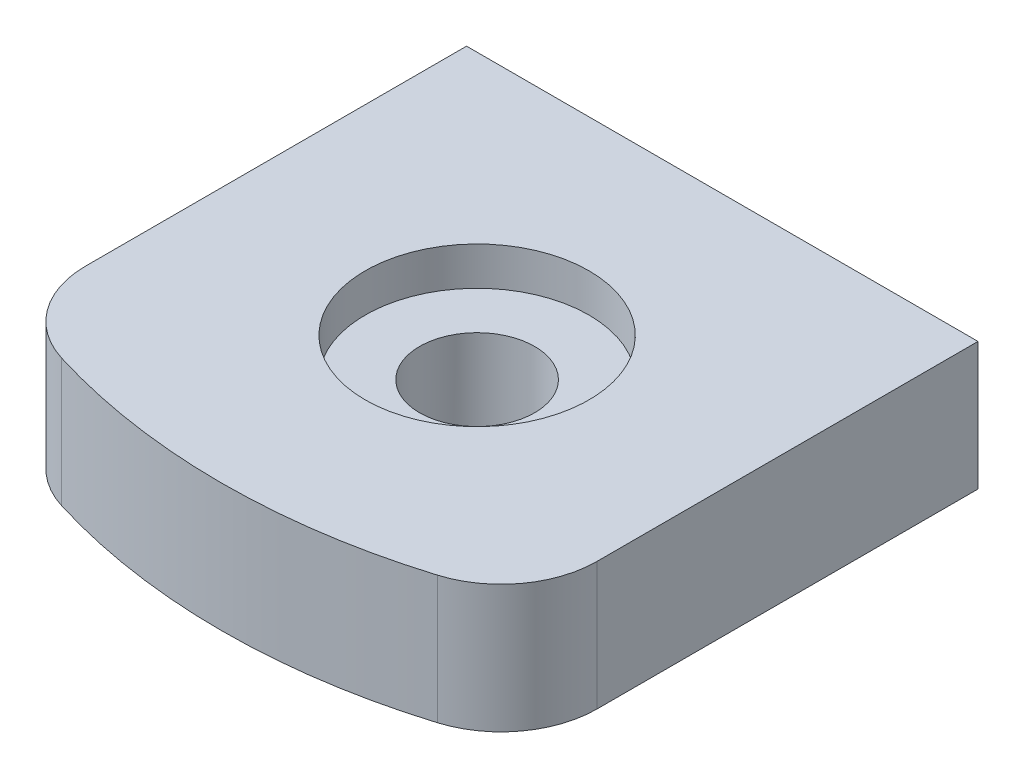
ISO-10303-21;
HEADER;
FILE_DESCRIPTION(('STEP AP214'),'2;1');
FILE_NAME('part.step','',(''),(''),'','','');
FILE_SCHEMA(('AUTOMOTIVE_DESIGN { 1 0 10303 214 1 1 1 1 }'));
ENDSEC;
DATA;
#1=APPLICATION_CONTEXT('core data for automotive mechanical design processes');
#2=APPLICATION_PROTOCOL_DEFINITION('international standard','automotive_design',2000,#1);
#3=PRODUCT_CONTEXT('',#1,'mechanical');
#4=PRODUCT('Part','Part','',(#3));
#5=PRODUCT_RELATED_PRODUCT_CATEGORY('part','',(#4));
#6=PRODUCT_DEFINITION_FORMATION('','',#4);
#7=PRODUCT_DEFINITION_CONTEXT('part definition',#1,'design');
#8=PRODUCT_DEFINITION('design','',#6,#7);
#9=PRODUCT_DEFINITION_SHAPE('','',#8);
#10=(LENGTH_UNIT() NAMED_UNIT(*) SI_UNIT(.MILLI.,.METRE.));
#11=(NAMED_UNIT(*) PLANE_ANGLE_UNIT() SI_UNIT($,.RADIAN.));
#12=(NAMED_UNIT(*) SI_UNIT($,.STERADIAN.) SOLID_ANGLE_UNIT());
#13=UNCERTAINTY_MEASURE_WITH_UNIT(LENGTH_MEASURE(1.E-05),#10,'distance_accuracy_value','');
#14=(GEOMETRIC_REPRESENTATION_CONTEXT(3) GLOBAL_UNCERTAINTY_ASSIGNED_CONTEXT((#13)) GLOBAL_UNIT_ASSIGNED_CONTEXT((#10,
#11,#12)) REPRESENTATION_CONTEXT('',''));
#15=CARTESIAN_POINT('',(0.,0.,0.));
#16=DIRECTION('',(0.,0.,1.));
#17=DIRECTION('',(1.,0.,0.));
#18=AXIS2_PLACEMENT_3D('',#15,#16,#17);
#19=CARTESIAN_POINT('',(-6.,-1.,0.));
#20=DIRECTION('',(0.,-1.,0.));
#21=DIRECTION('',(0.,0.,-1.));
#22=AXIS2_PLACEMENT_3D('',#19,#20,#21);
#23=PLANE('',#22);
#24=CARTESIAN_POINT('',(0.,-1.,74.5433459879591));
#25=DIRECTION('',(0.,-1.,0.));
#26=DIRECTION('',(0.,0.,-1.));
#27=AXIS2_PLACEMENT_3D('',#24,#25,#26);
#28=CIRCLE('',#27,0.900000000000005);
#29=CARTESIAN_POINT('',(0.,-1.,73.6433459879591));
#30=VERTEX_POINT('',#29);
#31=EDGE_CURVE('E137',#30,#30,#28,.F.);
#32=ORIENTED_EDGE('',*,*,#31,.T.);
#33=EDGE_LOOP('',(#32));
#34=FACE_BOUND('',#33,.T.);
#35=DIRECTION('',(1.,0.,0.));
#36=VECTOR('',#35,1.);
#37=CARTESIAN_POINT('',(-6.,-1.,70.7084973778708));
#38=LINE('',#37,#36);
#39=CARTESIAN_POINT('',(-4.,-1.,70.7084973778708));
#40=VERTEX_POINT('',#39);
#41=CARTESIAN_POINT('',(4.,-1.,70.7084973778708));
#42=VERTEX_POINT('',#41);
#43=EDGE_CURVE('E117',#40,#42,#38,.T.);
#44=ORIENTED_EDGE('',*,*,#43,.T.);
#45=DIRECTION('',(0.,0.,1.));
#46=VECTOR('',#45,1.);
#47=CARTESIAN_POINT('',(4.,-1.,12.7084973778708));
#48=LINE('',#47,#46);
#49=CARTESIAN_POINT('',(4.,-1.,76.6673843925951));
#50=VERTEX_POINT('',#49);
#51=EDGE_CURVE('E102',#42,#50,#48,.T.);
#52=ORIENTED_EDGE('',*,*,#51,.T.);
#53=CARTESIAN_POINT('',(2.5,-1.,76.6673843925951));
#54=DIRECTION('',(0.,-1.,0.));
#55=DIRECTION('',(0.,0.,-1.));
#56=AXIS2_PLACEMENT_3D('',#53,#54,#55);
#57=CIRCLE('',#56,1.5);
#58=CARTESIAN_POINT('',(2.94117647058823,-1.,78.1010382287073));
#59=VERTEX_POINT('',#58);
#60=EDGE_CURVE('E60',#59,#50,#57,.F.);
#61=ORIENTED_EDGE('',*,*,#60,.F.);
#62=CARTESIAN_POINT('',(0.,-1.,68.5433459879591));
#63=DIRECTION('',(0.,-1.,0.));
#64=DIRECTION('',(0.,0.,-1.));
#65=AXIS2_PLACEMENT_3D('',#62,#63,#64);
#66=CIRCLE('',#65,10.);
#67=CARTESIAN_POINT('',(-2.94117647058823,-1.,78.1010382287073));
#68=VERTEX_POINT('',#67);
#69=EDGE_CURVE('E112',#59,#68,#66,.T.);
#70=ORIENTED_EDGE('',*,*,#69,.T.);
#71=CARTESIAN_POINT('',(-2.5,-1.,76.6673843925951));
#72=DIRECTION('',(0.,-1.,0.));
#73=DIRECTION('',(0.,0.,-1.));
#74=AXIS2_PLACEMENT_3D('',#71,#72,#73);
#75=CIRCLE('',#74,1.5);
#76=CARTESIAN_POINT('',(-4.,-1.,76.6673843925951));
#77=VERTEX_POINT('',#76);
#78=EDGE_CURVE('E143',#77,#68,#75,.F.);
#79=ORIENTED_EDGE('',*,*,#78,.F.);
#80=DIRECTION('',(0.,0.,-1.));
#81=VECTOR('',#80,1.);
#82=CARTESIAN_POINT('',(-4.,-1.,77.7084973778708));
#83=LINE('',#82,#81);
#84=EDGE_CURVE('E139',#77,#40,#83,.T.);
#85=ORIENTED_EDGE('',*,*,#84,.T.);
#86=EDGE_LOOP('',(#44,#52,#61,#70,#79,#85));
#87=FACE_BOUND('',#86,.T.);
#88=ADVANCED_FACE('F43',(#34,#87),#23,.T.);
#89=CARTESIAN_POINT('',(-6.,1.,0.));
#90=DIRECTION('',(0.,1.,0.));
#91=DIRECTION('',(0.,0.,1.));
#92=AXIS2_PLACEMENT_3D('',#89,#90,#91);
#93=PLANE('',#92);
#94=CARTESIAN_POINT('',(0.,1.,74.5433459879591));
#95=DIRECTION('',(0.,1.,0.));
#96=DIRECTION('',(0.,0.,1.));
#97=AXIS2_PLACEMENT_3D('',#94,#95,#96);
#98=CIRCLE('',#97,1.74999999999999);
#99=CARTESIAN_POINT('',(0.,1.,76.2933459879591));
#100=VERTEX_POINT('',#99);
#101=EDGE_CURVE('E119',#100,#100,#98,.F.);
#102=ORIENTED_EDGE('',*,*,#101,.T.);
#103=EDGE_LOOP('',(#102));
#104=FACE_BOUND('',#103,.T.);
#105=DIRECTION('',(-1.,0.,0.));
#106=VECTOR('',#105,1.);
#107=CARTESIAN_POINT('',(-6.,1.,70.7084973778708));
#108=LINE('',#107,#106);
#109=CARTESIAN_POINT('',(4.,1.,70.7084973778708));
#110=VERTEX_POINT('',#109);
#111=CARTESIAN_POINT('',(-4.,1.,70.7084973778708));
#112=VERTEX_POINT('',#111);
#113=EDGE_CURVE('E111',#110,#112,#108,.T.);
#114=ORIENTED_EDGE('',*,*,#113,.T.);
#115=DIRECTION('',(0.,0.,1.));
#116=VECTOR('',#115,1.);
#117=CARTESIAN_POINT('',(-4.,1.,77.7084973778708));
#118=LINE('',#117,#116);
#119=CARTESIAN_POINT('',(-4.,1.,76.6673843925951));
#120=VERTEX_POINT('',#119);
#121=EDGE_CURVE('E138',#112,#120,#118,.T.);
#122=ORIENTED_EDGE('',*,*,#121,.T.);
#123=CARTESIAN_POINT('',(-2.5,1.,76.6673843925951));
#124=DIRECTION('',(0.,1.,0.));
#125=DIRECTION('',(0.,0.,1.));
#126=AXIS2_PLACEMENT_3D('',#123,#124,#125);
#127=CIRCLE('',#126,1.5);
#128=CARTESIAN_POINT('',(-2.94117647058823,1.,78.1010382287073));
#129=VERTEX_POINT('',#128);
#130=EDGE_CURVE('E142',#129,#120,#127,.F.);
#131=ORIENTED_EDGE('',*,*,#130,.F.);
#132=CARTESIAN_POINT('',(0.,1.,68.5433459879591));
#133=DIRECTION('',(0.,1.,0.));
#134=DIRECTION('',(0.,0.,1.));
#135=AXIS2_PLACEMENT_3D('',#132,#133,#134);
#136=CIRCLE('',#135,10.);
#137=CARTESIAN_POINT('',(2.94117647058823,1.,78.1010382287073));
#138=VERTEX_POINT('',#137);
#139=EDGE_CURVE('E141',#129,#138,#136,.T.);
#140=ORIENTED_EDGE('',*,*,#139,.T.);
#141=CARTESIAN_POINT('',(2.5,1.,76.6673843925951));
#142=DIRECTION('',(0.,1.,0.));
#143=DIRECTION('',(0.,0.,1.));
#144=AXIS2_PLACEMENT_3D('',#141,#142,#143);
#145=CIRCLE('',#144,1.5);
#146=CARTESIAN_POINT('',(4.,1.,76.6673843925951));
#147=VERTEX_POINT('',#146);
#148=EDGE_CURVE('E47',#147,#138,#145,.F.);
#149=ORIENTED_EDGE('',*,*,#148,.F.);
#150=DIRECTION('',(0.,0.,-1.));
#151=VECTOR('',#150,1.);
#152=CARTESIAN_POINT('',(4.,1.,12.7084973778708));
#153=LINE('',#152,#151);
#154=EDGE_CURVE('E101',#147,#110,#153,.T.);
#155=ORIENTED_EDGE('',*,*,#154,.T.);
#156=EDGE_LOOP('',(#114,#122,#131,#140,#149,#155));
#157=FACE_BOUND('',#156,.T.);
#158=ADVANCED_FACE('F109',(#104,#157),#93,.T.);
#159=CARTESIAN_POINT('',(0.,2.5,68.5433459879591));
#160=DIRECTION('',(0.,-1.,0.));
#161=DIRECTION('',(0.,0.,-1.));
#162=AXIS2_PLACEMENT_3D('',#159,#160,#161);
#163=CYLINDRICAL_SURFACE('',#162,10.);
#164=DIRECTION('',(0.,-1.,0.));
#165=VECTOR('',#164,1.);
#166=CARTESIAN_POINT('',(2.94117647058823,2.5,78.1010382287073));
#167=LINE('',#166,#165);
#168=EDGE_CURVE('E123',#59,#138,#167,.F.);
#169=ORIENTED_EDGE('',*,*,#168,.T.);
#170=ORIENTED_EDGE('',*,*,#139,.F.);
#171=DIRECTION('',(0.,-1.,0.));
#172=VECTOR('',#171,1.);
#173=CARTESIAN_POINT('',(-2.94117647058823,2.5,78.1010382287073));
#174=LINE('',#173,#172);
#175=EDGE_CURVE('E127',#129,#68,#174,.T.);
#176=ORIENTED_EDGE('',*,*,#175,.T.);
#177=ORIENTED_EDGE('',*,*,#69,.F.);
#178=EDGE_LOOP('',(#169,#170,#176,#177));
#179=FACE_BOUND('',#178,.T.);
#180=ADVANCED_FACE('F173',(#179),#163,.T.);
#181=CARTESIAN_POINT('',(4.,2.5,12.7084973778708));
#182=DIRECTION('',(-1.,0.,0.));
#183=DIRECTION('',(0.,0.,1.));
#184=AXIS2_PLACEMENT_3D('',#181,#182,#183);
#185=PLANE('',#184);
#186=ORIENTED_EDGE('',*,*,#154,.F.);
#187=DIRECTION('',(0.,-1.,0.));
#188=VECTOR('',#187,1.);
#189=CARTESIAN_POINT('',(4.,2.5,76.6673843925951));
#190=LINE('',#189,#188);
#191=EDGE_CURVE('E133',#147,#50,#190,.T.);
#192=ORIENTED_EDGE('',*,*,#191,.T.);
#193=ORIENTED_EDGE('',*,*,#51,.F.);
#194=DIRECTION('',(0.,1.,0.));
#195=VECTOR('',#194,1.);
#196=CARTESIAN_POINT('',(4.,2.5,70.7084973778708));
#197=LINE('',#196,#195);
#198=EDGE_CURVE('E11',#42,#110,#197,.T.);
#199=ORIENTED_EDGE('',*,*,#198,.T.);
#200=EDGE_LOOP('',(#186,#192,#193,#199));
#201=FACE_BOUND('',#200,.T.);
#202=ADVANCED_FACE('F99',(#201),#185,.F.);
#203=CARTESIAN_POINT('',(-4.,2.5,77.7084973778708));
#204=DIRECTION('',(1.,0.,0.));
#205=DIRECTION('',(0.,0.,-1.));
#206=AXIS2_PLACEMENT_3D('',#203,#204,#205);
#207=PLANE('',#206);
#208=ORIENTED_EDGE('',*,*,#121,.F.);
#209=DIRECTION('',(0.,-1.,0.));
#210=VECTOR('',#209,1.);
#211=CARTESIAN_POINT('',(-4.,2.5,70.7084973778708));
#212=LINE('',#211,#210);
#213=EDGE_CURVE('E115',#112,#40,#212,.T.);
#214=ORIENTED_EDGE('',*,*,#213,.T.);
#215=ORIENTED_EDGE('',*,*,#84,.F.);
#216=DIRECTION('',(0.,-1.,0.));
#217=VECTOR('',#216,1.);
#218=CARTESIAN_POINT('',(-4.,2.5,76.6673843925951));
#219=LINE('',#218,#217);
#220=EDGE_CURVE('E130',#77,#120,#219,.F.);
#221=ORIENTED_EDGE('',*,*,#220,.T.);
#222=EDGE_LOOP('',(#208,#214,#215,#221));
#223=FACE_BOUND('',#222,.T.);
#224=ADVANCED_FACE('F181',(#223),#207,.F.);
#225=CARTESIAN_POINT('',(0.,0.,70.7084973778708));
#226=DIRECTION('',(0.,0.,1.));
#227=DIRECTION('',(1.,0.,0.));
#228=AXIS2_PLACEMENT_3D('',#225,#226,#227);
#229=PLANE('',#228);
#230=ORIENTED_EDGE('',*,*,#43,.F.);
#231=ORIENTED_EDGE('',*,*,#213,.F.);
#232=ORIENTED_EDGE('',*,*,#113,.F.);
#233=ORIENTED_EDGE('',*,*,#198,.F.);
#234=EDGE_LOOP('',(#230,#231,#232,#233));
#235=FACE_BOUND('',#234,.T.);
#236=ADVANCED_FACE('F114',(#235),#229,.F.);
#237=CARTESIAN_POINT('',(2.5,2.5,76.6673843925951));
#238=DIRECTION('',(0.,-1.,0.));
#239=DIRECTION('',(0.,0.,-1.));
#240=AXIS2_PLACEMENT_3D('',#237,#238,#239);
#241=CYLINDRICAL_SURFACE('',#240,1.5);
#242=ORIENTED_EDGE('',*,*,#191,.F.);
#243=ORIENTED_EDGE('',*,*,#148,.T.);
#244=ORIENTED_EDGE('',*,*,#168,.F.);
#245=ORIENTED_EDGE('',*,*,#60,.T.);
#246=EDGE_LOOP('',(#242,#243,#244,#245));
#247=FACE_BOUND('',#246,.T.);
#248=ADVANCED_FACE('F168',(#247),#241,.T.);
#249=CARTESIAN_POINT('',(-2.5,2.5,76.6673843925951));
#250=DIRECTION('',(0.,-1.,0.));
#251=DIRECTION('',(0.,0.,-1.));
#252=AXIS2_PLACEMENT_3D('',#249,#250,#251);
#253=CYLINDRICAL_SURFACE('',#252,1.5);
#254=ORIENTED_EDGE('',*,*,#175,.F.);
#255=ORIENTED_EDGE('',*,*,#130,.T.);
#256=ORIENTED_EDGE('',*,*,#220,.F.);
#257=ORIENTED_EDGE('',*,*,#78,.T.);
#258=EDGE_LOOP('',(#254,#255,#256,#257));
#259=FACE_BOUND('',#258,.T.);
#260=ADVANCED_FACE('F159',(#259),#253,.T.);
#261=CARTESIAN_POINT('',(0.,2.,74.5433459879591));
#262=DIRECTION('',(0.,1.,0.));
#263=DIRECTION('',(0.,0.,1.));
#264=AXIS2_PLACEMENT_3D('',#261,#262,#263);
#265=CYLINDRICAL_SURFACE('',#264,0.900000000000005);
#266=CARTESIAN_POINT('',(0.,0.400000000000001,74.5433459879591));
#267=DIRECTION('',(0.,1.,0.));
#268=DIRECTION('',(0.,0.,1.));
#269=AXIS2_PLACEMENT_3D('',#266,#267,#268);
#270=CIRCLE('',#269,0.900000000000012);
#271=CARTESIAN_POINT('',(0.,0.400000000000001,75.4433459879591));
#272=VERTEX_POINT('',#271);
#273=EDGE_CURVE('E126',#272,#272,#270,.T.);
#274=ORIENTED_EDGE('',*,*,#273,.T.);
#275=EDGE_LOOP('',(#274));
#276=FACE_BOUND('',#275,.T.);
#277=ORIENTED_EDGE('',*,*,#31,.F.);
#278=EDGE_LOOP('',(#277));
#279=FACE_BOUND('',#278,.T.);
#280=ADVANCED_FACE('F157',(#276,#279),#265,.F.);
#281=CARTESIAN_POINT('',(0.,2.,74.5433459879591));
#282=DIRECTION('',(0.,1.,0.));
#283=DIRECTION('',(0.,0.,1.));
#284=AXIS2_PLACEMENT_3D('',#281,#282,#283);
#285=CYLINDRICAL_SURFACE('',#284,1.74999999999999);
#286=CARTESIAN_POINT('',(0.,0.400000000000001,74.5433459879591));
#287=DIRECTION('',(0.,1.,0.));
#288=DIRECTION('',(0.,0.,1.));
#289=AXIS2_PLACEMENT_3D('',#286,#287,#288);
#290=CIRCLE('',#289,1.74999999999999);
#291=CARTESIAN_POINT('',(0.,0.400000000000001,76.2933459879591));
#292=VERTEX_POINT('',#291);
#293=EDGE_CURVE('E52',#292,#292,#290,.T.);
#294=ORIENTED_EDGE('',*,*,#293,.F.);
#295=EDGE_LOOP('',(#294));
#296=FACE_BOUND('',#295,.T.);
#297=ORIENTED_EDGE('',*,*,#101,.F.);
#298=EDGE_LOOP('',(#297));
#299=FACE_BOUND('',#298,.T.);
#300=ADVANCED_FACE('F45',(#296,#299),#285,.F.);
#301=CARTESIAN_POINT('',(0.900000000000012,0.400000000000001,74.5433459879591));
#302=DIRECTION('',(0.,-1.,0.));
#303=DIRECTION('',(0.,0.,-1.));
#304=AXIS2_PLACEMENT_3D('',#301,#302,#303);
#305=PLANE('',#304);
#306=ORIENTED_EDGE('',*,*,#273,.F.);
#307=EDGE_LOOP('',(#306));
#308=FACE_BOUND('',#307,.T.);
#309=ORIENTED_EDGE('',*,*,#293,.T.);
#310=EDGE_LOOP('',(#309));
#311=FACE_BOUND('',#310,.T.);
#312=ADVANCED_FACE('F166',(#308,#311),#305,.F.);
#313=CLOSED_SHELL('',(#88,#158,#180,#202,#224,#236,#248,#260,#280,#300,#312));
#314=MANIFOLD_SOLID_BREP('B2',#313);
#315=ADVANCED_BREP_SHAPE_REPRESENTATION('',(#18,#314),#14);
#316=SHAPE_DEFINITION_REPRESENTATION(#9,#315);
ENDSEC;
END-ISO-10303-21;
